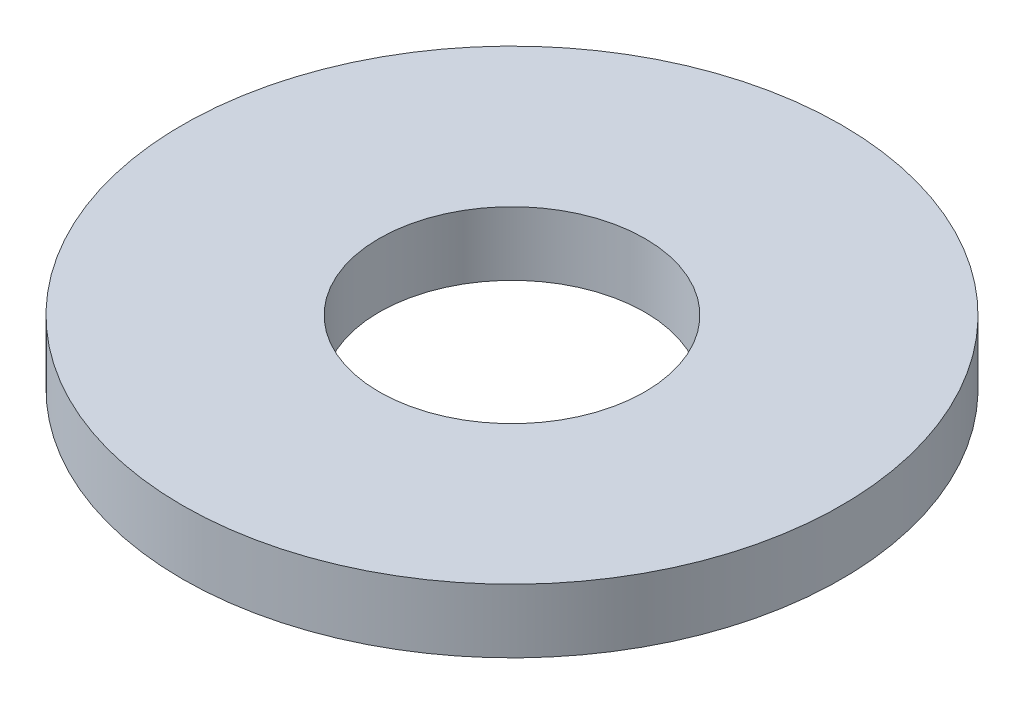
ISO-10303-21;
HEADER;
FILE_DESCRIPTION(('STEP AP214'),'2;1');
FILE_NAME('part.step','',(''),(''),'','','');
FILE_SCHEMA(('AUTOMOTIVE_DESIGN { 1 0 10303 214 1 1 1 1 }'));
ENDSEC;
DATA;
#1=APPLICATION_CONTEXT('core data for automotive mechanical design processes');
#2=APPLICATION_PROTOCOL_DEFINITION('international standard','automotive_design',2000,#1);
#3=PRODUCT_CONTEXT('',#1,'mechanical');
#4=PRODUCT('Part','Part','',(#3));
#5=PRODUCT_RELATED_PRODUCT_CATEGORY('part','',(#4));
#6=PRODUCT_DEFINITION_FORMATION('','',#4);
#7=PRODUCT_DEFINITION_CONTEXT('part definition',#1,'design');
#8=PRODUCT_DEFINITION('design','',#6,#7);
#9=PRODUCT_DEFINITION_SHAPE('','',#8);
#10=(LENGTH_UNIT() NAMED_UNIT(*) SI_UNIT(.MILLI.,.METRE.));
#11=(NAMED_UNIT(*) PLANE_ANGLE_UNIT() SI_UNIT($,.RADIAN.));
#12=(NAMED_UNIT(*) SI_UNIT($,.STERADIAN.) SOLID_ANGLE_UNIT());
#13=UNCERTAINTY_MEASURE_WITH_UNIT(LENGTH_MEASURE(1.E-05),#10,'distance_accuracy_value','');
#14=(GEOMETRIC_REPRESENTATION_CONTEXT(3) GLOBAL_UNCERTAINTY_ASSIGNED_CONTEXT((#13)) GLOBAL_UNIT_ASSIGNED_CONTEXT((#10,
#11,#12)) REPRESENTATION_CONTEXT('',''));
#15=CARTESIAN_POINT('',(0.,0.,0.));
#16=DIRECTION('',(0.,0.,1.));
#17=DIRECTION('',(1.,0.,0.));
#18=AXIS2_PLACEMENT_3D('',#15,#16,#17);
#19=CARTESIAN_POINT('',(0.,0.762,0.));
#20=DIRECTION('',(0.,1.,0.));
#21=DIRECTION('',(0.,0.,1.));
#22=AXIS2_PLACEMENT_3D('',#19,#20,#21);
#23=PLANE('',#22);
#24=CARTESIAN_POINT('',(0.,0.762,0.));
#25=DIRECTION('',(0.,1.,0.));
#26=DIRECTION('',(0.,0.,1.));
#27=AXIS2_PLACEMENT_3D('',#24,#25,#26);
#28=CIRCLE('',#27,3.937);
#29=CARTESIAN_POINT('',(0.,0.762,3.937));
#30=VERTEX_POINT('',#29);
#31=EDGE_CURVE('E10',#30,#30,#28,.T.);
#32=ORIENTED_EDGE('',*,*,#31,.T.);
#33=EDGE_LOOP('',(#32));
#34=FACE_BOUND('',#33,.T.);
#35=CARTESIAN_POINT('',(0.,0.762,0.));
#36=DIRECTION('',(0.,1.,0.));
#37=DIRECTION('',(0.,0.,1.));
#38=AXIS2_PLACEMENT_3D('',#35,#36,#37);
#39=CIRCLE('',#38,1.5875);
#40=CARTESIAN_POINT('',(0.,0.762,1.5875));
#41=VERTEX_POINT('',#40);
#42=EDGE_CURVE('E47',#41,#41,#39,.T.);
#43=ORIENTED_EDGE('',*,*,#42,.F.);
#44=EDGE_LOOP('',(#43));
#45=FACE_BOUND('',#44,.T.);
#46=ADVANCED_FACE('F34',(#34,#45),#23,.T.);
#47=CARTESIAN_POINT('',(0.,0.,0.));
#48=DIRECTION('',(0.,1.,0.));
#49=DIRECTION('',(0.,0.,1.));
#50=AXIS2_PLACEMENT_3D('',#47,#48,#49);
#51=PLANE('',#50);
#52=CARTESIAN_POINT('',(0.,0.,0.));
#53=DIRECTION('',(0.,1.,0.));
#54=DIRECTION('',(0.,0.,1.));
#55=AXIS2_PLACEMENT_3D('',#52,#53,#54);
#56=CIRCLE('',#55,3.937);
#57=CARTESIAN_POINT('',(0.,0.,3.937));
#58=VERTEX_POINT('',#57);
#59=EDGE_CURVE('E38',#58,#58,#56,.T.);
#60=ORIENTED_EDGE('',*,*,#59,.F.);
#61=EDGE_LOOP('',(#60));
#62=FACE_BOUND('',#61,.T.);
#63=CARTESIAN_POINT('',(0.,0.,0.));
#64=DIRECTION('',(0.,1.,0.));
#65=DIRECTION('',(0.,0.,1.));
#66=AXIS2_PLACEMENT_3D('',#63,#64,#65);
#67=CIRCLE('',#66,1.5875);
#68=CARTESIAN_POINT('',(0.,0.,1.5875));
#69=VERTEX_POINT('',#68);
#70=EDGE_CURVE('E49',#69,#69,#67,.T.);
#71=ORIENTED_EDGE('',*,*,#70,.T.);
#72=EDGE_LOOP('',(#71));
#73=FACE_BOUND('',#72,.T.);
#74=ADVANCED_FACE('F61',(#62,#73),#51,.F.);
#75=CARTESIAN_POINT('',(0.,0.762,0.));
#76=DIRECTION('',(0.,-1.,0.));
#77=DIRECTION('',(0.,0.,-1.));
#78=AXIS2_PLACEMENT_3D('',#75,#76,#77);
#79=CYLINDRICAL_SURFACE('',#78,3.937);
#80=ORIENTED_EDGE('',*,*,#31,.F.);
#81=EDGE_LOOP('',(#80));
#82=FACE_BOUND('',#81,.T.);
#83=ORIENTED_EDGE('',*,*,#59,.T.);
#84=EDGE_LOOP('',(#83));
#85=FACE_BOUND('',#84,.T.);
#86=ADVANCED_FACE('F36',(#82,#85),#79,.T.);
#87=CARTESIAN_POINT('',(0.,0.762,0.));
#88=DIRECTION('',(0.,-1.,0.));
#89=DIRECTION('',(0.,0.,-1.));
#90=AXIS2_PLACEMENT_3D('',#87,#88,#89);
#91=CYLINDRICAL_SURFACE('',#90,1.5875);
#92=ORIENTED_EDGE('',*,*,#42,.T.);
#93=EDGE_LOOP('',(#92));
#94=FACE_BOUND('',#93,.T.);
#95=ORIENTED_EDGE('',*,*,#70,.F.);
#96=EDGE_LOOP('',(#95));
#97=FACE_BOUND('',#96,.T.);
#98=ADVANCED_FACE('F57',(#94,#97),#91,.F.);
#99=CLOSED_SHELL('',(#46,#74,#86,#98));
#100=MANIFOLD_SOLID_BREP('B2',#99);
#101=ADVANCED_BREP_SHAPE_REPRESENTATION('',(#18,#100),#14);
#102=SHAPE_DEFINITION_REPRESENTATION(#9,#101);
ENDSEC;
END-ISO-10303-21;
